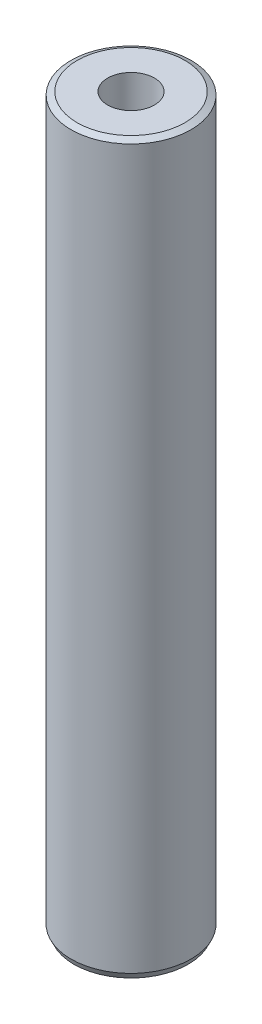
ISO-10303-21;
HEADER;
FILE_DESCRIPTION(('STEP AP214'),'2;1');
FILE_NAME('part.step','',(''),(''),'','','');
FILE_SCHEMA(('AUTOMOTIVE_DESIGN { 1 0 10303 214 1 1 1 1 }'));
ENDSEC;
DATA;
#1=APPLICATION_CONTEXT('core data for automotive mechanical design processes');
#2=APPLICATION_PROTOCOL_DEFINITION('international standard','automotive_design',2000,#1);
#3=PRODUCT_CONTEXT('',#1,'mechanical');
#4=PRODUCT('Part','Part','',(#3));
#5=PRODUCT_RELATED_PRODUCT_CATEGORY('part','',(#4));
#6=PRODUCT_DEFINITION_FORMATION('','',#4);
#7=PRODUCT_DEFINITION_CONTEXT('part definition',#1,'design');
#8=PRODUCT_DEFINITION('design','',#6,#7);
#9=PRODUCT_DEFINITION_SHAPE('','',#8);
#10=(LENGTH_UNIT() NAMED_UNIT(*) SI_UNIT(.MILLI.,.METRE.));
#11=(NAMED_UNIT(*) PLANE_ANGLE_UNIT() SI_UNIT($,.RADIAN.));
#12=(NAMED_UNIT(*) SI_UNIT($,.STERADIAN.) SOLID_ANGLE_UNIT());
#13=UNCERTAINTY_MEASURE_WITH_UNIT(LENGTH_MEASURE(1.E-05),#10,'distance_accuracy_value','');
#14=(GEOMETRIC_REPRESENTATION_CONTEXT(3) GLOBAL_UNCERTAINTY_ASSIGNED_CONTEXT((#13)) GLOBAL_UNIT_ASSIGNED_CONTEXT((#10,
#11,#12)) REPRESENTATION_CONTEXT('',''));
#15=CARTESIAN_POINT('',(0.,0.,0.));
#16=DIRECTION('',(0.,0.,1.));
#17=DIRECTION('',(1.,0.,0.));
#18=AXIS2_PLACEMENT_3D('',#15,#16,#17);
#19=CARTESIAN_POINT('',(0.,121.087244037849,0.));
#20=DIRECTION('',(0.,-1.,0.));
#21=DIRECTION('',(0.,0.,-1.));
#22=AXIS2_PLACEMENT_3D('',#19,#20,#21);
#23=CYLINDRICAL_SURFACE('',#22,10.);
#24=CARTESIAN_POINT('',(0.,120.588814431611,0.));
#25=DIRECTION('',(0.,1.,0.));
#26=DIRECTION('',(0.,0.,1.));
#27=AXIS2_PLACEMENT_3D('',#24,#25,#26);
#28=CIRCLE('',#27,10.);
#29=CARTESIAN_POINT('',(0.,120.588814431611,-10.));
#30=VERTEX_POINT('',#29);
#31=EDGE_CURVE('E50',#30,#30,#28,.F.);
#32=CARTESIAN_POINT('',(0.,1.02042330454465,0.));
#33=DIRECTION('',(0.,1.,0.));
#34=DIRECTION('',(0.,0.,1.));
#35=AXIS2_PLACEMENT_3D('',#32,#33,#34);
#36=CIRCLE('',#35,10.);
#37=CARTESIAN_POINT('',(0.,1.02042330454465,-10.));
#38=VERTEX_POINT('',#37);
#39=EDGE_CURVE('E51',#38,#38,#36,.T.);
#40=CARTESIAN_POINT('',(0.,120.588814431611,-10.));
#41=CARTESIAN_POINT('',(0.,119.343310357371,-10.));
#42=CARTESIAN_POINT('',(0.,118.097806283131,-10.));
#43=CARTESIAN_POINT('',(0.,115.60679813465,-10.));
#44=CARTESIAN_POINT('',(0.,114.36129406041,-10.));
#45=CARTESIAN_POINT('',(0.,111.870285911929,-10.));
#46=CARTESIAN_POINT('',(0.,110.624781837689,-10.));
#47=CARTESIAN_POINT('',(0.,108.133773689209,-10.));
#48=CARTESIAN_POINT('',(0.,106.888269614968,-10.));
#49=CARTESIAN_POINT('',(0.,104.397261466488,-10.));
#50=CARTESIAN_POINT('',(0.,103.151757392247,-10.));
#51=CARTESIAN_POINT('',(0.,100.660749243767,-10.));
#52=CARTESIAN_POINT('',(0.,99.4152451695266,-10.));
#53=CARTESIAN_POINT('',(0.,96.9242370210461,-10.));
#54=CARTESIAN_POINT('',(0.,95.6787329468058,-10.));
#55=CARTESIAN_POINT('',(0.,93.1877247983252,-10.));
#56=CARTESIAN_POINT('',(0.,91.9422207240849,-10.));
#57=CARTESIAN_POINT('',(0.,89.4512125756044,-10.));
#58=CARTESIAN_POINT('',(0.,88.2057085013641,-10.));
#59=CARTESIAN_POINT('',(0.,85.7147003528836,-10.));
#60=CARTESIAN_POINT('',(0.,84.4691962786433,-10.));
#61=CARTESIAN_POINT('',(0.,81.9781881301627,-10.));
#62=CARTESIAN_POINT('',(0.,80.7326840559224,-10.));
#63=CARTESIAN_POINT('',(0.,78.2416759074419,-10.));
#64=CARTESIAN_POINT('',(0.,76.9961718332016,-10.));
#65=CARTESIAN_POINT('',(0.,74.5051636847211,-10.));
#66=CARTESIAN_POINT('',(0.,73.2596596104808,-10.));
#67=CARTESIAN_POINT('',(0.,70.7686514620002,-10.));
#68=CARTESIAN_POINT('',(0.,69.52314738776,-10.));
#69=CARTESIAN_POINT('',(0.,67.0321392392794,-10.));
#70=CARTESIAN_POINT('',(0.,65.7866351650391,-10.));
#71=CARTESIAN_POINT('',(0.,63.2956270165586,-10.));
#72=CARTESIAN_POINT('',(0.,62.0501229423183,-10.));
#73=CARTESIAN_POINT('',(0.,59.5591147938377,-10.));
#74=CARTESIAN_POINT('',(0.,58.3136107195975,-10.));
#75=CARTESIAN_POINT('',(0.,55.8226025711169,-10.));
#76=CARTESIAN_POINT('',(0.,54.5770984968766,-10.));
#77=CARTESIAN_POINT('',(0.,52.0860903483961,-10.));
#78=CARTESIAN_POINT('',(0.,50.8405862741558,-10.));
#79=CARTESIAN_POINT('',(0.,48.3495781256752,-10.));
#80=CARTESIAN_POINT('',(0.,47.1040740514349,-10.));
#81=CARTESIAN_POINT('',(0.,44.6130659029544,-10.));
#82=CARTESIAN_POINT('',(0.,43.3675618287141,-10.));
#83=CARTESIAN_POINT('',(0.,40.8765536802336,-10.));
#84=CARTESIAN_POINT('',(0.,39.6310496059933,-10.));
#85=CARTESIAN_POINT('',(0.,37.1400414575127,-10.));
#86=CARTESIAN_POINT('',(0.,35.8945373832724,-10.));
#87=CARTESIAN_POINT('',(0.,33.4035292347919,-10.));
#88=CARTESIAN_POINT('',(0.,32.1580251605516,-10.));
#89=CARTESIAN_POINT('',(0.,29.6670170120711,-10.));
#90=CARTESIAN_POINT('',(0.,28.4215129378308,-10.));
#91=CARTESIAN_POINT('',(0.,25.9305047893502,-10.));
#92=CARTESIAN_POINT('',(0.,24.6850007151099,-10.));
#93=CARTESIAN_POINT('',(0.,22.1939925666294,-10.));
#94=CARTESIAN_POINT('',(0.,20.9484884923891,-10.));
#95=CARTESIAN_POINT('',(0.,18.4574803439085,-10.));
#96=CARTESIAN_POINT('',(0.,17.2119762696683,-10.));
#97=CARTESIAN_POINT('',(0.,14.7209681211877,-10.));
#98=CARTESIAN_POINT('',(0.,13.4754640469474,-10.));
#99=CARTESIAN_POINT('',(0.,10.9844558984669,-10.));
#100=CARTESIAN_POINT('',(0.,9.73895182422661,-10.));
#101=CARTESIAN_POINT('',(0.,7.24794367574605,-10.));
#102=CARTESIAN_POINT('',(0.,6.00243960150576,-10.));
#103=CARTESIAN_POINT('',(0.,3.51143145302521,-10.));
#104=CARTESIAN_POINT('',(0.,2.26592737878493,-10.));
#105=CARTESIAN_POINT('',(0.,1.02042330454465,-10.));
#106=B_SPLINE_CURVE_WITH_KNOTS('',3,(#40,#41,#42,#43,#44,#45,#46,#47,#48,#49,#50,#51,#52,#53,
#54,#55,#56,#57,#58,#59,#60,#61,#62,#63,#64,#65,#66,#67,#68,#69,#70,#71,#72,#73,#74,#75,#76,#77,
#78,#79,#80,#81,#82,#83,#84,#85,#86,#87,#88,#89,#90,#91,#92,#93,#94,#95,#96,#97,#98,#99,#100,
#101,#102,#103,#104,#105),.UNSPECIFIED.,.F.,.F.,(4,2,2,2,2,2,2,2,2,2,2,2,2,2,2,2,2,2,2,2,2,2,2,
2,2,2,2,2,2,2,2,2,4),(0.,3.73651222272084,7.47302444544168,11.2095366681625,14.9460488908833,
18.6825611136042,22.419073336325,26.1555855590458,29.8920977817667,33.6286100044875,
37.3651222272084,41.1016344499292,44.83814667265,48.5746588953709,52.3111711180917,
56.0476833408125,59.7841955635334,63.5207077862542,67.257220008975,70.9937322316959,
74.7302444544167,78.4667566771375,82.2032688998583,85.9397811225792,89.6762933453,
93.4128055680209,97.1493177907417,100.885830013463,104.622342236183,108.358854458904,
112.095366681625,115.831878904346,119.568391127067),.UNSPECIFIED.);
#107=EDGE_CURVE('BSEAM39',#30,#38,#106,.T.);
#108=ORIENTED_EDGE('',*,*,#31,.T.);
#109=ORIENTED_EDGE('',*,*,#39,.T.);
#110=ORIENTED_EDGE('',*,*,#107,.T.);
#111=ORIENTED_EDGE('',*,*,#107,.F.);
#112=EDGE_LOOP('',(#108,#110,#109,#111));
#113=FACE_BOUND('',#112,.T.);
#114=ADVANCED_FACE('F39',(#113),#23,.T.);
#115=CARTESIAN_POINT('',(0.,121.087244037849,0.));
#116=DIRECTION('',(0.,1.,0.));
#117=DIRECTION('',(0.,0.,1.));
#118=AXIS2_PLACEMENT_3D('',#115,#116,#117);
#119=PLANE('',#118);
#120=CARTESIAN_POINT('',(0.,121.087244037849,0.));
#121=DIRECTION('',(0.,1.,0.));
#122=DIRECTION('',(0.,0.,1.));
#123=AXIS2_PLACEMENT_3D('',#120,#121,#122);
#124=CIRCLE('',#123,8.97957669545569);
#125=CARTESIAN_POINT('',(0.,121.087244037849,8.97957669545569));
#126=VERTEX_POINT('',#125);
#127=EDGE_CURVE('E54',#126,#126,#124,.T.);
#128=ORIENTED_EDGE('',*,*,#127,.T.);
#129=EDGE_LOOP('',(#128));
#130=FACE_BOUND('',#129,.T.);
#131=CARTESIAN_POINT('',(0.,121.087244037849,0.));
#132=DIRECTION('',(0.,1.,0.));
#133=DIRECTION('',(0.,0.,1.));
#134=AXIS2_PLACEMENT_3D('',#131,#132,#133);
#135=CIRCLE('',#134,3.89339084778676);
#136=CARTESIAN_POINT('',(0.,121.087244037849,-3.89339084778676));
#137=VERTEX_POINT('',#136);
#138=EDGE_CURVE('E58',#137,#137,#135,.T.);
#139=ORIENTED_EDGE('',*,*,#138,.F.);
#140=EDGE_LOOP('',(#139));
#141=FACE_BOUND('',#140,.T.);
#142=ADVANCED_FACE('F69',(#130,#141),#119,.T.);
#143=CARTESIAN_POINT('',(0.,0.,0.));
#144=DIRECTION('',(0.,1.,0.));
#145=DIRECTION('',(0.,0.,1.));
#146=AXIS2_PLACEMENT_3D('',#143,#144,#145);
#147=PLANE('',#146);
#148=CARTESIAN_POINT('',(0.,0.,0.));
#149=DIRECTION('',(0.,1.,0.));
#150=DIRECTION('',(0.,0.,1.));
#151=AXIS2_PLACEMENT_3D('',#148,#149,#150);
#152=CIRCLE('',#151,9.50157039376231);
#153=CARTESIAN_POINT('',(0.,0.,9.50157039376231));
#154=VERTEX_POINT('',#153);
#155=EDGE_CURVE('E10',#154,#154,#152,.F.);
#156=ORIENTED_EDGE('',*,*,#155,.T.);
#157=EDGE_LOOP('',(#156));
#158=FACE_BOUND('',#157,.T.);
#159=CARTESIAN_POINT('',(0.,0.,0.));
#160=DIRECTION('',(0.,1.,0.));
#161=DIRECTION('',(0.,0.,1.));
#162=AXIS2_PLACEMENT_3D('',#159,#160,#161);
#163=CIRCLE('',#162,3.89339084778676);
#164=CARTESIAN_POINT('',(0.,0.,-3.89339084778676));
#165=VERTEX_POINT('',#164);
#166=EDGE_CURVE('E63',#165,#165,#163,.T.);
#167=ORIENTED_EDGE('',*,*,#166,.T.);
#168=EDGE_LOOP('',(#167));
#169=FACE_BOUND('',#168,.T.);
#170=ADVANCED_FACE('F75',(#158,#169),#147,.F.);
#171=CARTESIAN_POINT('',(0.,121.087244037849,0.));
#172=DIRECTION('',(0.,-1.,0.));
#173=DIRECTION('',(0.,0.,-1.));
#174=AXIS2_PLACEMENT_3D('',#171,#172,#173);
#175=CYLINDRICAL_SURFACE('',#174,3.89339084778676);
#176=CARTESIAN_POINT('',(0.,121.087244037849,-3.89339084778676));
#177=CARTESIAN_POINT('',(0.,119.825918579121,-3.89339084778676));
#178=CARTESIAN_POINT('',(0.,118.564593120394,-3.89339084778676));
#179=CARTESIAN_POINT('',(0.,116.041942202939,-3.89339084778676));
#180=CARTESIAN_POINT('',(0.,114.780616744211,-3.89339084778676));
#181=CARTESIAN_POINT('',(0.,112.257965826756,-3.89339084778676));
#182=CARTESIAN_POINT('',(0.,110.996640368028,-3.89339084778676));
#183=CARTESIAN_POINT('',(0.,108.473989450573,-3.89339084778676));
#184=CARTESIAN_POINT('',(0.,107.212663991845,-3.89339084778676));
#185=CARTESIAN_POINT('',(0.,104.69001307439,-3.89339084778676));
#186=CARTESIAN_POINT('',(0.,103.428687615663,-3.89339084778676));
#187=CARTESIAN_POINT('',(0.,100.906036698207,-3.89339084778676));
#188=CARTESIAN_POINT('',(0.,99.6447112394798,-3.89339084778676));
#189=CARTESIAN_POINT('',(0.,97.1220603220246,-3.89339084778676));
#190=CARTESIAN_POINT('',(0.,95.860734863297,-3.89339084778676));
#191=CARTESIAN_POINT('',(0.,93.3380839458418,-3.89339084778676));
#192=CARTESIAN_POINT('',(0.,92.0767584871142,-3.89339084778676));
#193=CARTESIAN_POINT('',(0.,89.5541075696591,-3.89339084778676));
#194=CARTESIAN_POINT('',(0.,88.2927821109315,-3.89339084778676));
#195=CARTESIAN_POINT('',(0.,85.7701311934763,-3.89339084778676));
#196=CARTESIAN_POINT('',(0.,84.5088057347487,-3.89339084778676));
#197=CARTESIAN_POINT('',(0.,81.9861548172935,-3.89339084778676));
#198=CARTESIAN_POINT('',(0.,80.7248293585659,-3.89339084778676));
#199=CARTESIAN_POINT('',(0.,78.2021784411107,-3.89339084778676));
#200=CARTESIAN_POINT('',(0.,76.9408529823831,-3.89339084778676));
#201=CARTESIAN_POINT('',(0.,74.4182020649279,-3.89339084778676));
#202=CARTESIAN_POINT('',(0.,73.1568766062004,-3.89339084778676));
#203=CARTESIAN_POINT('',(0.,70.6342256887452,-3.89339084778676));
#204=CARTESIAN_POINT('',(0.,69.3729002300176,-3.89339084778676));
#205=CARTESIAN_POINT('',(0.,66.8502493125624,-3.89339084778676));
#206=CARTESIAN_POINT('',(0.,65.5889238538348,-3.89339084778676));
#207=CARTESIAN_POINT('',(0.,63.0662729363796,-3.89339084778676));
#208=CARTESIAN_POINT('',(0.,61.804947477652,-3.89339084778676));
#209=CARTESIAN_POINT('',(0.,59.2822965601968,-3.89339084778676));
#210=CARTESIAN_POINT('',(0.,58.0209711014692,-3.89339084778676));
#211=CARTESIAN_POINT('',(0.,55.4983201840141,-3.89339084778676));
#212=CARTESIAN_POINT('',(0.,54.2369947252865,-3.89339084778676));
#213=CARTESIAN_POINT('',(0.,51.7143438078313,-3.89339084778676));
#214=CARTESIAN_POINT('',(0.,50.4530183491037,-3.89339084778676));
#215=CARTESIAN_POINT('',(0.,47.9303674316485,-3.89339084778676));
#216=CARTESIAN_POINT('',(0.,46.6690419729209,-3.89339084778676));
#217=CARTESIAN_POINT('',(0.,44.1463910554657,-3.89339084778676));
#218=CARTESIAN_POINT('',(0.,42.8850655967381,-3.89339084778676));
#219=CARTESIAN_POINT('',(0.,40.3624146792829,-3.89339084778676));
#220=CARTESIAN_POINT('',(0.,39.1010892205554,-3.89339084778676));
#221=CARTESIAN_POINT('',(0.,36.5784383031002,-3.89339084778676));
#222=CARTESIAN_POINT('',(0.,35.3171128443726,-3.89339084778676));
#223=CARTESIAN_POINT('',(0.,32.7944619269174,-3.89339084778676));
#224=CARTESIAN_POINT('',(0.,31.5331364681898,-3.89339084778676));
#225=CARTESIAN_POINT('',(0.,29.0104855507346,-3.89339084778676));
#226=CARTESIAN_POINT('',(0.,27.749160092007,-3.89339084778676));
#227=CARTESIAN_POINT('',(0.,25.2265091745518,-3.89339084778676));
#228=CARTESIAN_POINT('',(0.,23.9651837158242,-3.89339084778676));
#229=CARTESIAN_POINT('',(0.,21.4425327983691,-3.89339084778676));
#230=CARTESIAN_POINT('',(0.,20.1812073396415,-3.89339084778676));
#231=CARTESIAN_POINT('',(0.,17.6585564221863,-3.89339084778676));
#232=CARTESIAN_POINT('',(0.,16.3972309634587,-3.89339084778676));
#233=CARTESIAN_POINT('',(0.,13.8745800460035,-3.89339084778676));
#234=CARTESIAN_POINT('',(0.,12.6132545872759,-3.89339084778676));
#235=CARTESIAN_POINT('',(0.,10.0906036698207,-3.89339084778676));
#236=CARTESIAN_POINT('',(0.,8.82927821109314,-3.89339084778676));
#237=CARTESIAN_POINT('',(0.,6.30662729363795,-3.89339084778676));
#238=CARTESIAN_POINT('',(0.,5.04530183491036,-3.89339084778676));
#239=CARTESIAN_POINT('',(0.,2.52265091745517,-3.89339084778676));
#240=CARTESIAN_POINT('',(0.,1.26132545872758,-3.89339084778676));
#241=CARTESIAN_POINT('',(0.,0.,-3.89339084778676));
#242=B_SPLINE_CURVE_WITH_KNOTS('',3,(#176,#177,#178,#179,#180,#181,#182,#183,#184,#185,#186,
#187,#188,#189,#190,#191,#192,#193,#194,#195,#196,#197,#198,#199,#200,#201,#202,#203,#204,#205,
#206,#207,#208,#209,#210,#211,#212,#213,#214,#215,#216,#217,#218,#219,#220,#221,#222,#223,#224,
#225,#226,#227,#228,#229,#230,#231,#232,#233,#234,#235,#236,#237,#238,#239,#240,#241),
.UNSPECIFIED.,.F.,.F.,(4,2,2,2,2,2,2,2,2,2,2,2,2,2,2,2,2,2,2,2,2,2,2,2,2,2,2,2,2,2,2,2,4),(0.,
3.78397637618277,7.56795275236555,11.3519291285483,15.1359055047311,18.9198818809139,
22.7038582570967,26.4878346332794,30.2718110094622,34.055787385645,37.8397637618278,
41.6237401380105,45.4077165141933,49.1916928903761,52.9756692665589,56.7596456427416,
60.5436220189244,64.3275983951072,68.11157477129,71.8955511474728,75.6795275236556,
79.4635038998383,83.2474802760211,87.0314566522039,90.8154330283866,94.5994094045694,
98.3833857807522,102.167362156935,105.951338533118,109.735314909301,113.519291285483,
117.303267661666,121.087244037849),.UNSPECIFIED.);
#243=EDGE_CURVE('BSEAM70',#137,#165,#242,.T.);
#244=ORIENTED_EDGE('',*,*,#138,.T.);
#245=ORIENTED_EDGE('',*,*,#166,.F.);
#246=ORIENTED_EDGE('',*,*,#243,.T.);
#247=ORIENTED_EDGE('',*,*,#243,.F.);
#248=EDGE_LOOP('',(#244,#246,#245,#247));
#249=FACE_BOUND('',#248,.T.);
#250=ADVANCED_FACE('F70',(#249),#175,.F.);
#251=CARTESIAN_POINT('',(0.,121.087244037849,0.));
#252=DIRECTION('',(0.,-1.,0.));
#253=DIRECTION('',(0.,0.,-1.));
#254=AXIS2_PLACEMENT_3D('',#251,#252,#253);
#255=CONICAL_SURFACE('',#254,8.97957669545569,1.11642829736503);
#256=ORIENTED_EDGE('',*,*,#31,.F.);
#257=EDGE_LOOP('',(#256));
#258=FACE_BOUND('',#257,.T.);
#259=ORIENTED_EDGE('',*,*,#127,.F.);
#260=EDGE_LOOP('',(#259));
#261=FACE_BOUND('',#260,.T.);
#262=ADVANCED_FACE('F81',(#258,#261),#255,.T.);
#263=CARTESIAN_POINT('',(0.,1.02042330454465,0.));
#264=DIRECTION('',(0.,1.,0.));
#265=DIRECTION('',(0.,0.,1.));
#266=AXIS2_PLACEMENT_3D('',#263,#264,#265);
#267=CONICAL_SURFACE('',#266,10.,0.454368029429871);
#268=ORIENTED_EDGE('',*,*,#155,.F.);
#269=EDGE_LOOP('',(#268));
#270=FACE_BOUND('',#269,.T.);
#271=ORIENTED_EDGE('',*,*,#39,.F.);
#272=EDGE_LOOP('',(#271));
#273=FACE_BOUND('',#272,.T.);
#274=ADVANCED_FACE('F45',(#270,#273),#267,.T.);
#275=CLOSED_SHELL('',(#114,#142,#170,#250,#262,#274));
#276=MANIFOLD_SOLID_BREP('B2',#275);
#277=ADVANCED_BREP_SHAPE_REPRESENTATION('',(#18,#276),#14);
#278=SHAPE_DEFINITION_REPRESENTATION(#9,#277);
ENDSEC;
END-ISO-10303-21;
